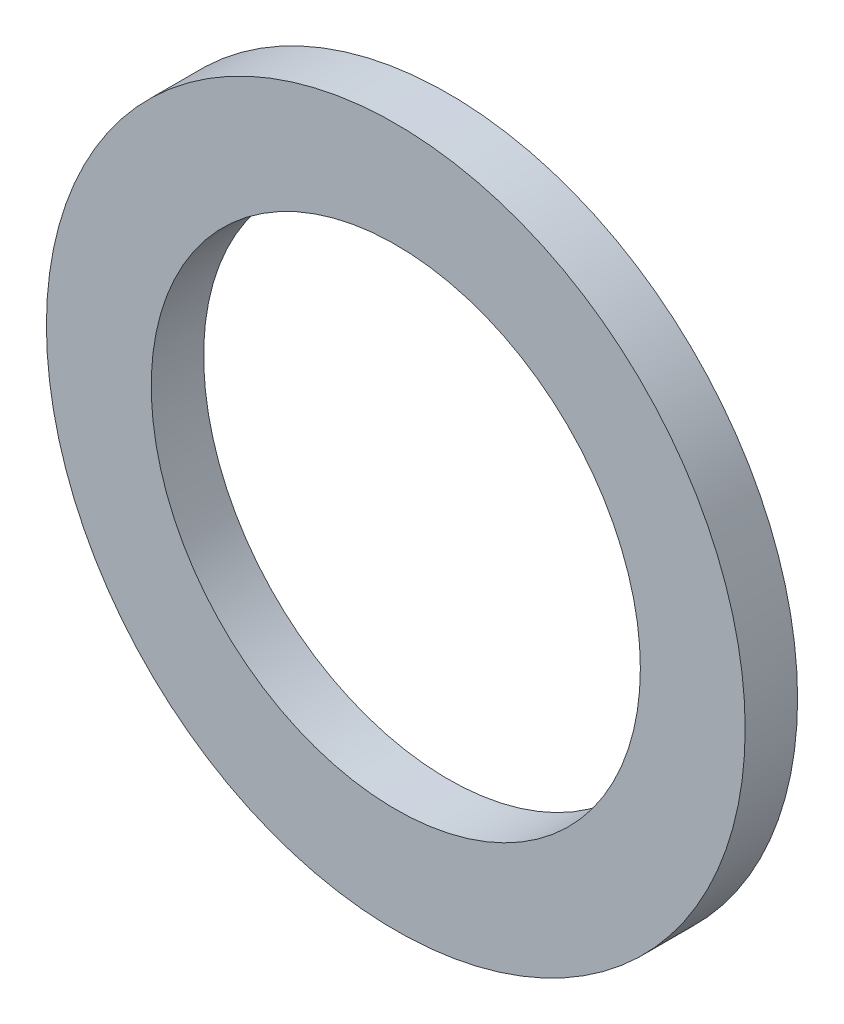
ISO-10303-21;
HEADER;
FILE_DESCRIPTION(('STEP AP214'),'2;1');
FILE_NAME('part.step','',(''),(''),'','','');
FILE_SCHEMA(('AUTOMOTIVE_DESIGN { 1 0 10303 214 1 1 1 1 }'));
ENDSEC;
DATA;
#1=APPLICATION_CONTEXT('core data for automotive mechanical design processes');
#2=APPLICATION_PROTOCOL_DEFINITION('international standard','automotive_design',2000,#1);
#3=PRODUCT_CONTEXT('',#1,'mechanical');
#4=PRODUCT('Part','Part','',(#3));
#5=PRODUCT_RELATED_PRODUCT_CATEGORY('part','',(#4));
#6=PRODUCT_DEFINITION_FORMATION('','',#4);
#7=PRODUCT_DEFINITION_CONTEXT('part definition',#1,'design');
#8=PRODUCT_DEFINITION('design','',#6,#7);
#9=PRODUCT_DEFINITION_SHAPE('','',#8);
#10=(LENGTH_UNIT() NAMED_UNIT(*) SI_UNIT(.MILLI.,.METRE.));
#11=(NAMED_UNIT(*) PLANE_ANGLE_UNIT() SI_UNIT($,.RADIAN.));
#12=(NAMED_UNIT(*) SI_UNIT($,.STERADIAN.) SOLID_ANGLE_UNIT());
#13=UNCERTAINTY_MEASURE_WITH_UNIT(LENGTH_MEASURE(1.E-05),#10,'distance_accuracy_value','');
#14=(GEOMETRIC_REPRESENTATION_CONTEXT(3) GLOBAL_UNCERTAINTY_ASSIGNED_CONTEXT((#13)) GLOBAL_UNIT_ASSIGNED_CONTEXT((#10,
#11,#12)) REPRESENTATION_CONTEXT('',''));
#15=CARTESIAN_POINT('',(0.,0.,0.));
#16=DIRECTION('',(0.,0.,1.));
#17=DIRECTION('',(1.,0.,0.));
#18=AXIS2_PLACEMENT_3D('',#15,#16,#17);
#19=CARTESIAN_POINT('',(0.,0.,-6.));
#20=DIRECTION('',(0.,0.,1.));
#21=DIRECTION('',(1.,0.,0.));
#22=AXIS2_PLACEMENT_3D('',#19,#20,#21);
#23=CYLINDRICAL_SURFACE('',#22,40.);
#24=CARTESIAN_POINT('',(0.,0.,-6.));
#25=DIRECTION('',(0.,0.,1.));
#26=DIRECTION('',(1.,0.,0.));
#27=AXIS2_PLACEMENT_3D('',#24,#25,#26);
#28=CIRCLE('',#27,40.);
#29=CARTESIAN_POINT('',(40.,0.,-6.));
#30=VERTEX_POINT('',#29);
#31=EDGE_CURVE('E10',#30,#30,#28,.T.);
#32=ORIENTED_EDGE('',*,*,#31,.T.);
#33=EDGE_LOOP('',(#32));
#34=FACE_BOUND('',#33,.T.);
#35=CARTESIAN_POINT('',(0.,0.,0.));
#36=DIRECTION('',(0.,0.,1.));
#37=DIRECTION('',(1.,0.,0.));
#38=AXIS2_PLACEMENT_3D('',#35,#36,#37);
#39=CIRCLE('',#38,40.);
#40=CARTESIAN_POINT('',(40.,0.,0.));
#41=VERTEX_POINT('',#40);
#42=EDGE_CURVE('E41',#41,#41,#39,.T.);
#43=ORIENTED_EDGE('',*,*,#42,.F.);
#44=EDGE_LOOP('',(#43));
#45=FACE_BOUND('',#44,.T.);
#46=ADVANCED_FACE('F38',(#34,#45),#23,.T.);
#47=CARTESIAN_POINT('',(0.,0.,-6.));
#48=DIRECTION('',(0.,0.,1.));
#49=DIRECTION('',(1.,0.,0.));
#50=AXIS2_PLACEMENT_3D('',#47,#48,#49);
#51=PLANE('',#50);
#52=CARTESIAN_POINT('',(0.,0.,-6.));
#53=DIRECTION('',(0.,0.,1.));
#54=DIRECTION('',(1.,0.,0.));
#55=AXIS2_PLACEMENT_3D('',#52,#53,#54);
#56=CIRCLE('',#55,28.);
#57=CARTESIAN_POINT('',(28.,0.,-6.));
#58=VERTEX_POINT('',#57);
#59=EDGE_CURVE('E51',#58,#58,#56,.T.);
#60=ORIENTED_EDGE('',*,*,#59,.T.);
#61=EDGE_LOOP('',(#60));
#62=FACE_BOUND('',#61,.T.);
#63=ORIENTED_EDGE('',*,*,#31,.F.);
#64=EDGE_LOOP('',(#63));
#65=FACE_BOUND('',#64,.T.);
#66=ADVANCED_FACE('F62',(#62,#65),#51,.F.);
#67=CARTESIAN_POINT('',(0.,0.,0.));
#68=DIRECTION('',(0.,0.,1.));
#69=DIRECTION('',(1.,0.,0.));
#70=AXIS2_PLACEMENT_3D('',#67,#68,#69);
#71=PLANE('',#70);
#72=CARTESIAN_POINT('',(0.,0.,0.));
#73=DIRECTION('',(0.,0.,1.));
#74=DIRECTION('',(1.,0.,0.));
#75=AXIS2_PLACEMENT_3D('',#72,#73,#74);
#76=CIRCLE('',#75,28.);
#77=CARTESIAN_POINT('',(28.,0.,0.));
#78=VERTEX_POINT('',#77);
#79=EDGE_CURVE('E53',#78,#78,#76,.T.);
#80=ORIENTED_EDGE('',*,*,#79,.F.);
#81=EDGE_LOOP('',(#80));
#82=FACE_BOUND('',#81,.T.);
#83=ORIENTED_EDGE('',*,*,#42,.T.);
#84=EDGE_LOOP('',(#83));
#85=FACE_BOUND('',#84,.T.);
#86=ADVANCED_FACE('F68',(#82,#85),#71,.T.);
#87=CARTESIAN_POINT('',(0.,0.,-6.));
#88=DIRECTION('',(0.,0.,1.));
#89=DIRECTION('',(1.,0.,0.));
#90=AXIS2_PLACEMENT_3D('',#87,#88,#89);
#91=CYLINDRICAL_SURFACE('',#90,28.);
#92=ORIENTED_EDGE('',*,*,#59,.F.);
#93=EDGE_LOOP('',(#92));
#94=FACE_BOUND('',#93,.T.);
#95=ORIENTED_EDGE('',*,*,#79,.T.);
#96=EDGE_LOOP('',(#95));
#97=FACE_BOUND('',#96,.T.);
#98=ADVANCED_FACE('F65',(#94,#97),#91,.F.);
#99=CLOSED_SHELL('',(#46,#66,#86,#98));
#100=MANIFOLD_SOLID_BREP('B2',#99);
#101=ADVANCED_BREP_SHAPE_REPRESENTATION('',(#18,#100),#14);
#102=SHAPE_DEFINITION_REPRESENTATION(#9,#101);
ENDSEC;
END-ISO-10303-21;
